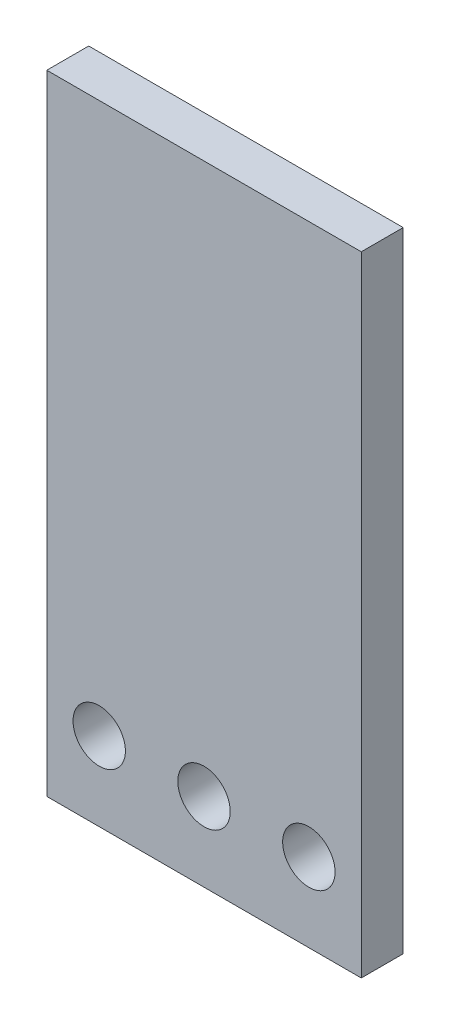
ISO-10303-21;
HEADER;
FILE_DESCRIPTION(('STEP AP214'),'2;1');
FILE_NAME('part.step','',(''),(''),'','','');
FILE_SCHEMA(('AUTOMOTIVE_DESIGN { 1 0 10303 214 1 1 1 1 }'));
ENDSEC;
DATA;
#1=APPLICATION_CONTEXT('core data for automotive mechanical design processes');
#2=APPLICATION_PROTOCOL_DEFINITION('international standard','automotive_design',2000,#1);
#3=PRODUCT_CONTEXT('',#1,'mechanical');
#4=PRODUCT('Part','Part','',(#3));
#5=PRODUCT_RELATED_PRODUCT_CATEGORY('part','',(#4));
#6=PRODUCT_DEFINITION_FORMATION('','',#4);
#7=PRODUCT_DEFINITION_CONTEXT('part definition',#1,'design');
#8=PRODUCT_DEFINITION('design','',#6,#7);
#9=PRODUCT_DEFINITION_SHAPE('','',#8);
#10=(LENGTH_UNIT() NAMED_UNIT(*) SI_UNIT(.MILLI.,.METRE.));
#11=(NAMED_UNIT(*) PLANE_ANGLE_UNIT() SI_UNIT($,.RADIAN.));
#12=(NAMED_UNIT(*) SI_UNIT($,.STERADIAN.) SOLID_ANGLE_UNIT());
#13=UNCERTAINTY_MEASURE_WITH_UNIT(LENGTH_MEASURE(1.E-05),#10,'distance_accuracy_value','');
#14=(GEOMETRIC_REPRESENTATION_CONTEXT(3) GLOBAL_UNCERTAINTY_ASSIGNED_CONTEXT((#13)) GLOBAL_UNIT_ASSIGNED_CONTEXT((#10,
#11,#12)) REPRESENTATION_CONTEXT('',''));
#15=CARTESIAN_POINT('',(0.,0.,0.));
#16=DIRECTION('',(0.,0.,1.));
#17=DIRECTION('',(1.,0.,0.));
#18=AXIS2_PLACEMENT_3D('',#15,#16,#17);
#19=CARTESIAN_POINT('',(0.,0.,10.16));
#20=DIRECTION('',(0.,0.,-1.));
#21=DIRECTION('',(-1.,0.,0.));
#22=AXIS2_PLACEMENT_3D('',#19,#20,#21);
#23=PLANE('',#22);
#24=DIRECTION('',(0.,-1.,0.));
#25=VECTOR('',#24,1.);
#26=CARTESIAN_POINT('',(0.,0.,10.16));
#27=LINE('',#26,#25);
#28=CARTESIAN_POINT('',(0.,152.4,10.16));
#29=VERTEX_POINT('',#28);
#30=CARTESIAN_POINT('',(0.,0.,10.16));
#31=VERTEX_POINT('',#30);
#32=EDGE_CURVE('E92',#29,#31,#27,.T.);
#33=ORIENTED_EDGE('',*,*,#32,.T.);
#34=DIRECTION('',(1.,0.,0.));
#35=VECTOR('',#34,1.);
#36=CARTESIAN_POINT('',(0.,0.,10.16));
#37=LINE('',#36,#35);
#38=CARTESIAN_POINT('',(76.2,0.,10.16));
#39=VERTEX_POINT('',#38);
#40=EDGE_CURVE('E87',#31,#39,#37,.T.);
#41=ORIENTED_EDGE('',*,*,#40,.T.);
#42=DIRECTION('',(0.,1.,0.));
#43=VECTOR('',#42,1.);
#44=CARTESIAN_POINT('',(76.2,0.,10.16));
#45=LINE('',#44,#43);
#46=CARTESIAN_POINT('',(76.2,152.4,10.16));
#47=VERTEX_POINT('',#46);
#48=EDGE_CURVE('E90',#39,#47,#45,.T.);
#49=ORIENTED_EDGE('',*,*,#48,.T.);
#50=DIRECTION('',(-1.,0.,0.));
#51=VECTOR('',#50,1.);
#52=CARTESIAN_POINT('',(0.,152.4,10.16));
#53=LINE('',#52,#51);
#54=EDGE_CURVE('E57',#47,#29,#53,.T.);
#55=ORIENTED_EDGE('',*,*,#54,.T.);
#56=EDGE_LOOP('',(#33,#41,#49,#55));
#57=FACE_BOUND('',#56,.T.);
#58=CARTESIAN_POINT('',(12.7,19.05,10.16));
#59=DIRECTION('',(0.,0.,1.));
#60=DIRECTION('',(1.,0.,0.));
#61=AXIS2_PLACEMENT_3D('',#58,#59,#60);
#62=CIRCLE('',#61,6.35);
#63=CARTESIAN_POINT('',(19.05,19.05,10.16));
#64=VERTEX_POINT('',#63);
#65=EDGE_CURVE('E112',#64,#64,#62,.T.);
#66=ORIENTED_EDGE('',*,*,#65,.F.);
#67=EDGE_LOOP('',(#66));
#68=FACE_BOUND('',#67,.T.);
#69=CARTESIAN_POINT('',(38.1,19.05,10.16));
#70=DIRECTION('',(0.,0.,1.));
#71=DIRECTION('',(1.,0.,0.));
#72=AXIS2_PLACEMENT_3D('',#69,#70,#71);
#73=CIRCLE('',#72,6.35);
#74=CARTESIAN_POINT('',(44.45,19.05,10.16));
#75=VERTEX_POINT('',#74);
#76=EDGE_CURVE('E134',#75,#75,#73,.T.);
#77=ORIENTED_EDGE('',*,*,#76,.F.);
#78=EDGE_LOOP('',(#77));
#79=FACE_BOUND('',#78,.T.);
#80=CARTESIAN_POINT('',(63.5,19.05,10.16));
#81=DIRECTION('',(0.,0.,1.));
#82=DIRECTION('',(1.,0.,0.));
#83=AXIS2_PLACEMENT_3D('',#80,#81,#82);
#84=CIRCLE('',#83,6.35);
#85=CARTESIAN_POINT('',(69.85,19.05,10.16));
#86=VERTEX_POINT('',#85);
#87=EDGE_CURVE('E142',#86,#86,#84,.T.);
#88=ORIENTED_EDGE('',*,*,#87,.F.);
#89=EDGE_LOOP('',(#88));
#90=FACE_BOUND('',#89,.T.);
#91=ADVANCED_FACE('F39',(#57,#68,#79,#90),#23,.F.);
#92=CARTESIAN_POINT('',(0.,0.,0.));
#93=DIRECTION('',(0.,0.,-1.));
#94=DIRECTION('',(-1.,0.,0.));
#95=AXIS2_PLACEMENT_3D('',#92,#93,#94);
#96=PLANE('',#95);
#97=CARTESIAN_POINT('',(38.1,19.05,0.));
#98=DIRECTION('',(0.,0.,1.));
#99=DIRECTION('',(1.,0.,0.));
#100=AXIS2_PLACEMENT_3D('',#97,#98,#99);
#101=CIRCLE('',#100,6.35);
#102=CARTESIAN_POINT('',(44.45,19.05,0.));
#103=VERTEX_POINT('',#102);
#104=EDGE_CURVE('E138',#103,#103,#101,.T.);
#105=ORIENTED_EDGE('',*,*,#104,.T.);
#106=EDGE_LOOP('',(#105));
#107=FACE_BOUND('',#106,.T.);
#108=DIRECTION('',(0.,-1.,0.));
#109=VECTOR('',#108,1.);
#110=CARTESIAN_POINT('',(0.,0.,0.));
#111=LINE('',#110,#109);
#112=CARTESIAN_POINT('',(0.,152.4,0.));
#113=VERTEX_POINT('',#112);
#114=CARTESIAN_POINT('',(0.,0.,0.));
#115=VERTEX_POINT('',#114);
#116=EDGE_CURVE('E108',#113,#115,#111,.T.);
#117=ORIENTED_EDGE('',*,*,#116,.F.);
#118=DIRECTION('',(-1.,0.,0.));
#119=VECTOR('',#118,1.);
#120=CARTESIAN_POINT('',(0.,152.4,0.));
#121=LINE('',#120,#119);
#122=CARTESIAN_POINT('',(76.2,152.4,0.));
#123=VERTEX_POINT('',#122);
#124=EDGE_CURVE('E80',#123,#113,#121,.T.);
#125=ORIENTED_EDGE('',*,*,#124,.F.);
#126=DIRECTION('',(0.,1.,0.));
#127=VECTOR('',#126,1.);
#128=CARTESIAN_POINT('',(76.2,0.,0.));
#129=LINE('',#128,#127);
#130=CARTESIAN_POINT('',(76.2,0.,0.));
#131=VERTEX_POINT('',#130);
#132=EDGE_CURVE('E74',#131,#123,#129,.T.);
#133=ORIENTED_EDGE('',*,*,#132,.F.);
#134=DIRECTION('',(1.,0.,0.));
#135=VECTOR('',#134,1.);
#136=CARTESIAN_POINT('',(0.,0.,0.));
#137=LINE('',#136,#135);
#138=EDGE_CURVE('E97',#115,#131,#137,.T.);
#139=ORIENTED_EDGE('',*,*,#138,.F.);
#140=EDGE_LOOP('',(#117,#125,#133,#139));
#141=FACE_BOUND('',#140,.T.);
#142=CARTESIAN_POINT('',(12.7,19.05,0.));
#143=DIRECTION('',(0.,0.,1.));
#144=DIRECTION('',(1.,0.,0.));
#145=AXIS2_PLACEMENT_3D('',#142,#143,#144);
#146=CIRCLE('',#145,6.35);
#147=CARTESIAN_POINT('',(19.05,19.05,0.));
#148=VERTEX_POINT('',#147);
#149=EDGE_CURVE('E130',#148,#148,#146,.T.);
#150=ORIENTED_EDGE('',*,*,#149,.T.);
#151=EDGE_LOOP('',(#150));
#152=FACE_BOUND('',#151,.T.);
#153=CARTESIAN_POINT('',(63.5,19.05,0.));
#154=DIRECTION('',(0.,0.,1.));
#155=DIRECTION('',(1.,0.,0.));
#156=AXIS2_PLACEMENT_3D('',#153,#154,#155);
#157=CIRCLE('',#156,6.35);
#158=CARTESIAN_POINT('',(69.85,19.05,0.));
#159=VERTEX_POINT('',#158);
#160=EDGE_CURVE('E146',#159,#159,#157,.T.);
#161=ORIENTED_EDGE('',*,*,#160,.T.);
#162=EDGE_LOOP('',(#161));
#163=FACE_BOUND('',#162,.T.);
#164=ADVANCED_FACE('F125',(#107,#141,#152,#163),#96,.T.);
#165=CARTESIAN_POINT('',(0.,0.,10.16));
#166=DIRECTION('',(1.,0.,0.));
#167=DIRECTION('',(0.,0.,-1.));
#168=AXIS2_PLACEMENT_3D('',#165,#166,#167);
#169=PLANE('',#168);
#170=ORIENTED_EDGE('',*,*,#116,.T.);
#171=DIRECTION('',(0.,0.,-1.));
#172=VECTOR('',#171,1.);
#173=CARTESIAN_POINT('',(0.,0.,10.16));
#174=LINE('',#173,#172);
#175=EDGE_CURVE('E11',#31,#115,#174,.T.);
#176=ORIENTED_EDGE('',*,*,#175,.F.);
#177=ORIENTED_EDGE('',*,*,#32,.F.);
#178=DIRECTION('',(0.,0.,-1.));
#179=VECTOR('',#178,1.);
#180=CARTESIAN_POINT('',(0.,152.4,10.16));
#181=LINE('',#180,#179);
#182=EDGE_CURVE('E104',#29,#113,#181,.T.);
#183=ORIENTED_EDGE('',*,*,#182,.T.);
#184=EDGE_LOOP('',(#170,#176,#177,#183));
#185=FACE_BOUND('',#184,.T.);
#186=ADVANCED_FACE('F41',(#185),#169,.F.);
#187=CARTESIAN_POINT('',(0.,0.,10.16));
#188=DIRECTION('',(0.,1.,0.));
#189=DIRECTION('',(0.,0.,1.));
#190=AXIS2_PLACEMENT_3D('',#187,#188,#189);
#191=PLANE('',#190);
#192=ORIENTED_EDGE('',*,*,#138,.T.);
#193=DIRECTION('',(0.,0.,-1.));
#194=VECTOR('',#193,1.);
#195=CARTESIAN_POINT('',(76.2,0.,10.16));
#196=LINE('',#195,#194);
#197=EDGE_CURVE('E49',#39,#131,#196,.T.);
#198=ORIENTED_EDGE('',*,*,#197,.F.);
#199=ORIENTED_EDGE('',*,*,#40,.F.);
#200=ORIENTED_EDGE('',*,*,#175,.T.);
#201=EDGE_LOOP('',(#192,#198,#199,#200));
#202=FACE_BOUND('',#201,.T.);
#203=ADVANCED_FACE('F96',(#202),#191,.F.);
#204=CARTESIAN_POINT('',(76.2,0.,10.16));
#205=DIRECTION('',(-1.,0.,0.));
#206=DIRECTION('',(0.,0.,1.));
#207=AXIS2_PLACEMENT_3D('',#204,#205,#206);
#208=PLANE('',#207);
#209=ORIENTED_EDGE('',*,*,#132,.T.);
#210=DIRECTION('',(0.,0.,-1.));
#211=VECTOR('',#210,1.);
#212=CARTESIAN_POINT('',(76.2,152.4,10.16));
#213=LINE('',#212,#211);
#214=EDGE_CURVE('E99',#47,#123,#213,.T.);
#215=ORIENTED_EDGE('',*,*,#214,.F.);
#216=ORIENTED_EDGE('',*,*,#48,.F.);
#217=ORIENTED_EDGE('',*,*,#197,.T.);
#218=EDGE_LOOP('',(#209,#215,#216,#217));
#219=FACE_BOUND('',#218,.T.);
#220=ADVANCED_FACE('F100',(#219),#208,.F.);
#221=CARTESIAN_POINT('',(0.,152.4,10.16));
#222=DIRECTION('',(0.,-1.,0.));
#223=DIRECTION('',(0.,0.,-1.));
#224=AXIS2_PLACEMENT_3D('',#221,#222,#223);
#225=PLANE('',#224);
#226=ORIENTED_EDGE('',*,*,#124,.T.);
#227=ORIENTED_EDGE('',*,*,#182,.F.);
#228=ORIENTED_EDGE('',*,*,#54,.F.);
#229=ORIENTED_EDGE('',*,*,#214,.T.);
#230=EDGE_LOOP('',(#226,#227,#228,#229));
#231=FACE_BOUND('',#230,.T.);
#232=ADVANCED_FACE('F122',(#231),#225,.F.);
#233=CARTESIAN_POINT('',(12.7,19.05,10.16));
#234=DIRECTION('',(0.,0.,-1.));
#235=DIRECTION('',(-1.,0.,0.));
#236=AXIS2_PLACEMENT_3D('',#233,#234,#235);
#237=CYLINDRICAL_SURFACE('',#236,6.35);
#238=ORIENTED_EDGE('',*,*,#65,.T.);
#239=EDGE_LOOP('',(#238));
#240=FACE_BOUND('',#239,.T.);
#241=ORIENTED_EDGE('',*,*,#149,.F.);
#242=EDGE_LOOP('',(#241));
#243=FACE_BOUND('',#242,.T.);
#244=ADVANCED_FACE('F165',(#240,#243),#237,.F.);
#245=CARTESIAN_POINT('',(38.1,19.05,10.16));
#246=DIRECTION('',(0.,0.,-1.));
#247=DIRECTION('',(-1.,0.,0.));
#248=AXIS2_PLACEMENT_3D('',#245,#246,#247);
#249=CYLINDRICAL_SURFACE('',#248,6.35);
#250=ORIENTED_EDGE('',*,*,#76,.T.);
#251=EDGE_LOOP('',(#250));
#252=FACE_BOUND('',#251,.T.);
#253=ORIENTED_EDGE('',*,*,#104,.F.);
#254=EDGE_LOOP('',(#253));
#255=FACE_BOUND('',#254,.T.);
#256=ADVANCED_FACE('F211',(#252,#255),#249,.F.);
#257=CARTESIAN_POINT('',(63.5,19.05,10.16));
#258=DIRECTION('',(0.,0.,-1.));
#259=DIRECTION('',(-1.,0.,0.));
#260=AXIS2_PLACEMENT_3D('',#257,#258,#259);
#261=CYLINDRICAL_SURFACE('',#260,6.35);
#262=ORIENTED_EDGE('',*,*,#87,.T.);
#263=EDGE_LOOP('',(#262));
#264=FACE_BOUND('',#263,.T.);
#265=ORIENTED_EDGE('',*,*,#160,.F.);
#266=EDGE_LOOP('',(#265));
#267=FACE_BOUND('',#266,.T.);
#268=ADVANCED_FACE('F154',(#264,#267),#261,.F.);
#269=CLOSED_SHELL('',(#91,#164,#186,#203,#220,#232,#244,#256,#268));
#270=MANIFOLD_SOLID_BREP('B2',#269);
#271=ADVANCED_BREP_SHAPE_REPRESENTATION('',(#18,#270),#14);
#272=SHAPE_DEFINITION_REPRESENTATION(#9,#271);
ENDSEC;
END-ISO-10303-21;
